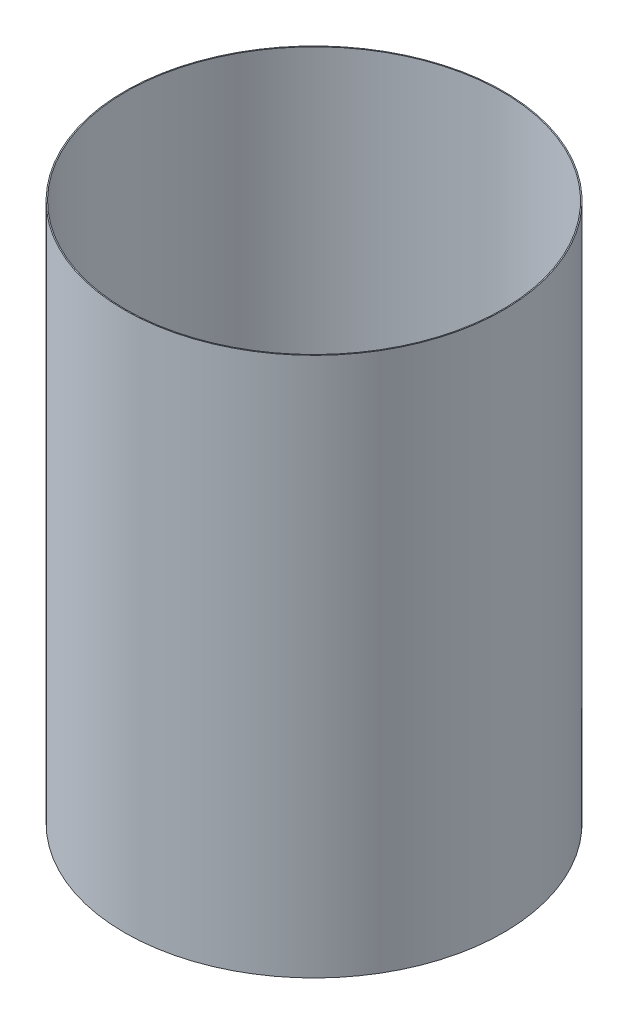
ISO-10303-21;
HEADER;
FILE_DESCRIPTION(('STEP AP214'),'2;1');
FILE_NAME('part.step','',(''),(''),'','','');
FILE_SCHEMA(('AUTOMOTIVE_DESIGN { 1 0 10303 214 1 1 1 1 }'));
ENDSEC;
DATA;
#1=APPLICATION_CONTEXT('core data for automotive mechanical design processes');
#2=APPLICATION_PROTOCOL_DEFINITION('international standard','automotive_design',2000,#1);
#3=PRODUCT_CONTEXT('',#1,'mechanical');
#4=PRODUCT('Part','Part','',(#3));
#5=PRODUCT_RELATED_PRODUCT_CATEGORY('part','',(#4));
#6=PRODUCT_DEFINITION_FORMATION('','',#4);
#7=PRODUCT_DEFINITION_CONTEXT('part definition',#1,'design');
#8=PRODUCT_DEFINITION('design','',#6,#7);
#9=PRODUCT_DEFINITION_SHAPE('','',#8);
#10=(LENGTH_UNIT() NAMED_UNIT(*) SI_UNIT(.MILLI.,.METRE.));
#11=(NAMED_UNIT(*) PLANE_ANGLE_UNIT() SI_UNIT($,.RADIAN.));
#12=(NAMED_UNIT(*) SI_UNIT($,.STERADIAN.) SOLID_ANGLE_UNIT());
#13=UNCERTAINTY_MEASURE_WITH_UNIT(LENGTH_MEASURE(1.E-05),#10,'distance_accuracy_value','');
#14=(GEOMETRIC_REPRESENTATION_CONTEXT(3) GLOBAL_UNCERTAINTY_ASSIGNED_CONTEXT((#13)) GLOBAL_UNIT_ASSIGNED_CONTEXT((#10,
#11,#12)) REPRESENTATION_CONTEXT('',''));
#15=CARTESIAN_POINT('',(0.,0.,0.));
#16=DIRECTION('',(0.,0.,1.));
#17=DIRECTION('',(1.,0.,0.));
#18=AXIS2_PLACEMENT_3D('',#15,#16,#17);
#19=CARTESIAN_POINT('',(0.,55.,0.));
#20=DIRECTION('',(0.,1.,0.));
#21=DIRECTION('',(0.,0.,1.));
#22=AXIS2_PLACEMENT_3D('',#19,#20,#21);
#23=CYLINDRICAL_SURFACE('',#22,46.863);
#24=CARTESIAN_POINT('',(0.,-153.255914232196,0.));
#25=DIRECTION('',(0.,1.,0.));
#26=DIRECTION('',(0.,0.,1.));
#27=AXIS2_PLACEMENT_3D('',#24,#25,#26);
#28=CIRCLE('',#27,46.863);
#29=CARTESIAN_POINT('',(0.,-153.255914232196,46.863));
#30=VERTEX_POINT('',#29);
#31=EDGE_CURVE('E45',#30,#30,#28,.T.);
#32=ORIENTED_EDGE('',*,*,#31,.T.);
#33=EDGE_LOOP('',(#32));
#34=FACE_BOUND('',#33,.T.);
#35=CARTESIAN_POINT('',(0.,-19.905914232196,0.));
#36=DIRECTION('',(0.,1.,0.));
#37=DIRECTION('',(0.,0.,1.));
#38=AXIS2_PLACEMENT_3D('',#35,#36,#37);
#39=CIRCLE('',#38,46.863);
#40=CARTESIAN_POINT('',(0.,-19.905914232196,46.863));
#41=VERTEX_POINT('',#40);
#42=EDGE_CURVE('E10',#41,#41,#39,.T.);
#43=ORIENTED_EDGE('',*,*,#42,.F.);
#44=EDGE_LOOP('',(#43));
#45=FACE_BOUND('',#44,.T.);
#46=ADVANCED_FACE('F31',(#34,#45),#23,.T.);
#47=CARTESIAN_POINT('',(-46.863,-19.905914232196,0.));
#48=DIRECTION('',(0.,-1.,0.));
#49=DIRECTION('',(0.,0.,-1.));
#50=AXIS2_PLACEMENT_3D('',#47,#48,#49);
#51=PLANE('',#50);
#52=CARTESIAN_POINT('',(0.,-19.905914232196,0.));
#53=DIRECTION('',(0.,1.,0.));
#54=DIRECTION('',(0.,0.,1.));
#55=AXIS2_PLACEMENT_3D('',#52,#53,#54);
#56=CIRCLE('',#55,46.609);
#57=CARTESIAN_POINT('',(0.,-19.905914232196,46.609));
#58=VERTEX_POINT('',#57);
#59=EDGE_CURVE('E37',#58,#58,#56,.T.);
#60=ORIENTED_EDGE('',*,*,#59,.F.);
#61=EDGE_LOOP('',(#60));
#62=FACE_BOUND('',#61,.T.);
#63=ORIENTED_EDGE('',*,*,#42,.T.);
#64=EDGE_LOOP('',(#63));
#65=FACE_BOUND('',#64,.T.);
#66=ADVANCED_FACE('F61',(#62,#65),#51,.F.);
#67=CARTESIAN_POINT('',(0.,55.,0.));
#68=DIRECTION('',(0.,1.,0.));
#69=DIRECTION('',(0.,0.,1.));
#70=AXIS2_PLACEMENT_3D('',#67,#68,#69);
#71=CYLINDRICAL_SURFACE('',#70,46.609);
#72=CARTESIAN_POINT('',(0.,-153.255914232196,0.));
#73=DIRECTION('',(0.,1.,0.));
#74=DIRECTION('',(0.,0.,1.));
#75=AXIS2_PLACEMENT_3D('',#72,#73,#74);
#76=CIRCLE('',#75,46.609);
#77=CARTESIAN_POINT('',(0.,-153.255914232196,46.609));
#78=VERTEX_POINT('',#77);
#79=EDGE_CURVE('E41',#78,#78,#76,.T.);
#80=ORIENTED_EDGE('',*,*,#79,.F.);
#81=EDGE_LOOP('',(#80));
#82=FACE_BOUND('',#81,.T.);
#83=ORIENTED_EDGE('',*,*,#59,.T.);
#84=EDGE_LOOP('',(#83));
#85=FACE_BOUND('',#84,.T.);
#86=ADVANCED_FACE('F56',(#82,#85),#71,.F.);
#87=CARTESIAN_POINT('',(-46.609,-153.255914232196,0.));
#88=DIRECTION('',(0.,1.,0.));
#89=DIRECTION('',(0.,0.,1.));
#90=AXIS2_PLACEMENT_3D('',#87,#88,#89);
#91=PLANE('',#90);
#92=ORIENTED_EDGE('',*,*,#31,.F.);
#93=EDGE_LOOP('',(#92));
#94=FACE_BOUND('',#93,.T.);
#95=ORIENTED_EDGE('',*,*,#79,.T.);
#96=EDGE_LOOP('',(#95));
#97=FACE_BOUND('',#96,.T.);
#98=ADVANCED_FACE('F53',(#94,#97),#91,.F.);
#99=CLOSED_SHELL('',(#46,#66,#86,#98));
#100=MANIFOLD_SOLID_BREP('B2',#99);
#101=ADVANCED_BREP_SHAPE_REPRESENTATION('',(#18,#100),#14);
#102=SHAPE_DEFINITION_REPRESENTATION(#9,#101);
ENDSEC;
END-ISO-10303-21;
